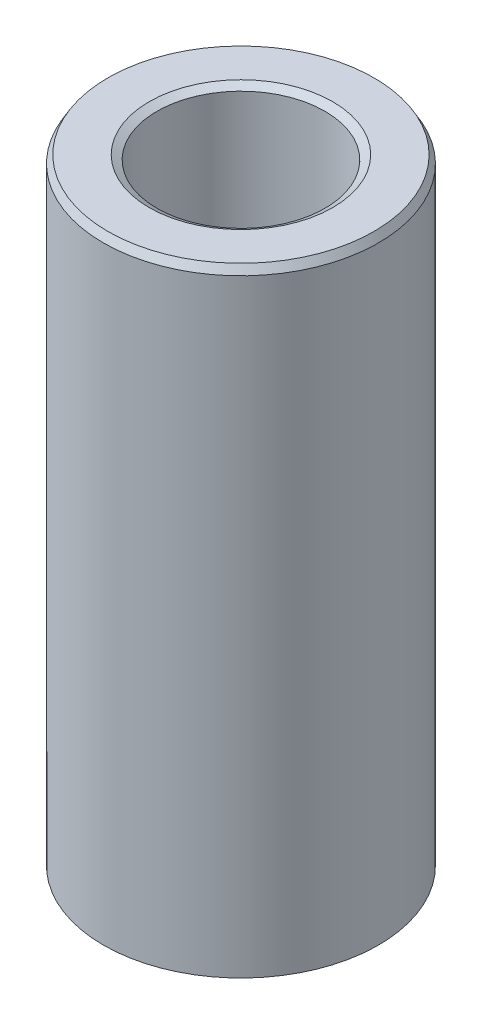
ISO-10303-21;
HEADER;
FILE_DESCRIPTION(('STEP AP214'),'2;1');
FILE_NAME('part.step','',(''),(''),'','','');
FILE_SCHEMA(('AUTOMOTIVE_DESIGN { 1 0 10303 214 1 1 1 1 }'));
ENDSEC;
DATA;
#1=APPLICATION_CONTEXT('core data for automotive mechanical design processes');
#2=APPLICATION_PROTOCOL_DEFINITION('international standard','automotive_design',2000,#1);
#3=PRODUCT_CONTEXT('',#1,'mechanical');
#4=PRODUCT('Part','Part','',(#3));
#5=PRODUCT_RELATED_PRODUCT_CATEGORY('part','',(#4));
#6=PRODUCT_DEFINITION_FORMATION('','',#4);
#7=PRODUCT_DEFINITION_CONTEXT('part definition',#1,'design');
#8=PRODUCT_DEFINITION('design','',#6,#7);
#9=PRODUCT_DEFINITION_SHAPE('','',#8);
#10=(LENGTH_UNIT() NAMED_UNIT(*) SI_UNIT(.MILLI.,.METRE.));
#11=(NAMED_UNIT(*) PLANE_ANGLE_UNIT() SI_UNIT($,.RADIAN.));
#12=(NAMED_UNIT(*) SI_UNIT($,.STERADIAN.) SOLID_ANGLE_UNIT());
#13=UNCERTAINTY_MEASURE_WITH_UNIT(LENGTH_MEASURE(1.E-05),#10,'distance_accuracy_value','');
#14=(GEOMETRIC_REPRESENTATION_CONTEXT(3) GLOBAL_UNCERTAINTY_ASSIGNED_CONTEXT((#13)) GLOBAL_UNIT_ASSIGNED_CONTEXT((#10,
#11,#12)) REPRESENTATION_CONTEXT('',''));
#15=CARTESIAN_POINT('',(0.,0.,0.));
#16=DIRECTION('',(0.,0.,1.));
#17=DIRECTION('',(1.,0.,0.));
#18=AXIS2_PLACEMENT_3D('',#15,#16,#17);
#19=CARTESIAN_POINT('',(0.,56.3848817626225,0.));
#20=DIRECTION('',(0.,-1.,0.));
#21=DIRECTION('',(0.,0.,-1.));
#22=AXIS2_PLACEMENT_3D('',#19,#20,#21);
#23=CYLINDRICAL_SURFACE('',#22,12.5);
#24=CARTESIAN_POINT('',(0.,0.404570411743452,0.));
#25=DIRECTION('',(0.,1.,0.));
#26=DIRECTION('',(0.,0.,1.));
#27=AXIS2_PLACEMENT_3D('',#24,#25,#26);
#28=CIRCLE('',#27,12.5);
#29=CARTESIAN_POINT('',(0.,0.404570411743452,12.5));
#30=VERTEX_POINT('',#29);
#31=EDGE_CURVE('E10',#30,#30,#28,.T.);
#32=ORIENTED_EDGE('',*,*,#31,.T.);
#33=EDGE_LOOP('',(#32));
#34=FACE_BOUND('',#33,.T.);
#35=CARTESIAN_POINT('',(0.,55.6841452542438,0.));
#36=DIRECTION('',(0.,1.,0.));
#37=DIRECTION('',(0.,0.,1.));
#38=AXIS2_PLACEMENT_3D('',#35,#36,#37);
#39=CIRCLE('',#38,12.5);
#40=CARTESIAN_POINT('',(0.,55.6841452542438,12.5));
#41=VERTEX_POINT('',#40);
#42=EDGE_CURVE('E50',#41,#41,#39,.F.);
#43=ORIENTED_EDGE('',*,*,#42,.T.);
#44=EDGE_LOOP('',(#43));
#45=FACE_BOUND('',#44,.T.);
#46=ADVANCED_FACE('F39',(#34,#45),#23,.T.);
#47=CARTESIAN_POINT('',(0.,56.3848817626225,0.));
#48=DIRECTION('',(0.,1.,0.));
#49=DIRECTION('',(0.,0.,1.));
#50=AXIS2_PLACEMENT_3D('',#47,#48,#49);
#51=PLANE('',#50);
#52=CARTESIAN_POINT('',(0.,56.3848817626225,0.));
#53=DIRECTION('',(0.,1.,0.));
#54=DIRECTION('',(0.,0.,1.));
#55=AXIS2_PLACEMENT_3D('',#52,#53,#54);
#56=CIRCLE('',#55,8.34144304614783);
#57=CARTESIAN_POINT('',(0.,56.3848817626225,8.34144304614783));
#58=VERTEX_POINT('',#57);
#59=EDGE_CURVE('E58',#58,#58,#56,.F.);
#60=ORIENTED_EDGE('',*,*,#59,.T.);
#61=EDGE_LOOP('',(#60));
#62=FACE_BOUND('',#61,.T.);
#63=CARTESIAN_POINT('',(0.,56.3848817626225,0.));
#64=DIRECTION('',(0.,1.,0.));
#65=DIRECTION('',(0.,0.,1.));
#66=AXIS2_PLACEMENT_3D('',#63,#64,#65);
#67=CIRCLE('',#66,12.0954295882565);
#68=CARTESIAN_POINT('',(0.,56.3848817626225,12.0954295882565));
#69=VERTEX_POINT('',#68);
#70=EDGE_CURVE('E61',#69,#69,#67,.T.);
#71=ORIENTED_EDGE('',*,*,#70,.T.);
#72=EDGE_LOOP('',(#71));
#73=FACE_BOUND('',#72,.T.);
#74=ADVANCED_FACE('F88',(#62,#73),#51,.T.);
#75=CARTESIAN_POINT('',(0.,0.,0.));
#76=DIRECTION('',(0.,1.,0.));
#77=DIRECTION('',(0.,0.,1.));
#78=AXIS2_PLACEMENT_3D('',#75,#76,#77);
#79=PLANE('',#78);
#80=CARTESIAN_POINT('',(0.,0.,0.));
#81=DIRECTION('',(0.,1.,0.));
#82=DIRECTION('',(0.,0.,1.));
#83=AXIS2_PLACEMENT_3D('',#80,#81,#82);
#84=CIRCLE('',#83,8.04527694951255);
#85=CARTESIAN_POINT('',(0.,0.,8.04527694951255));
#86=VERTEX_POINT('',#85);
#87=EDGE_CURVE('E51',#86,#86,#84,.T.);
#88=ORIENTED_EDGE('',*,*,#87,.T.);
#89=EDGE_LOOP('',(#88));
#90=FACE_BOUND('',#89,.T.);
#91=CARTESIAN_POINT('',(0.,0.,0.));
#92=DIRECTION('',(0.,1.,0.));
#93=DIRECTION('',(0.,0.,1.));
#94=AXIS2_PLACEMENT_3D('',#91,#92,#93);
#95=CIRCLE('',#94,11.7992634916213);
#96=CARTESIAN_POINT('',(0.,0.,11.7992634916213));
#97=VERTEX_POINT('',#96);
#98=EDGE_CURVE('E54',#97,#97,#95,.F.);
#99=ORIENTED_EDGE('',*,*,#98,.T.);
#100=EDGE_LOOP('',(#99));
#101=FACE_BOUND('',#100,.T.);
#102=ADVANCED_FACE('F83',(#90,#101),#79,.F.);
#103=CARTESIAN_POINT('',(0.,56.3848817626225,0.));
#104=DIRECTION('',(0.,-1.,0.));
#105=DIRECTION('',(0.,0.,-1.));
#106=AXIS2_PLACEMENT_3D('',#103,#104,#105);
#107=CYLINDRICAL_SURFACE('',#106,7.64070653776909);
#108=CARTESIAN_POINT('',(0.,55.980311350879,0.));
#109=DIRECTION('',(0.,1.,0.));
#110=DIRECTION('',(0.,0.,1.));
#111=AXIS2_PLACEMENT_3D('',#108,#109,#110);
#112=CIRCLE('',#111,7.64070653776909);
#113=CARTESIAN_POINT('',(0.,55.980311350879,7.64070653776909));
#114=VERTEX_POINT('',#113);
#115=EDGE_CURVE('E67',#114,#114,#112,.T.);
#116=ORIENTED_EDGE('',*,*,#115,.T.);
#117=EDGE_LOOP('',(#116));
#118=FACE_BOUND('',#117,.T.);
#119=CARTESIAN_POINT('',(0.,0.700736508378749,0.));
#120=DIRECTION('',(0.,1.,0.));
#121=DIRECTION('',(0.,0.,1.));
#122=AXIS2_PLACEMENT_3D('',#119,#120,#121);
#123=CIRCLE('',#122,7.64070653776909);
#124=CARTESIAN_POINT('',(0.,0.700736508378749,7.64070653776909));
#125=VERTEX_POINT('',#124);
#126=EDGE_CURVE('E69',#125,#125,#123,.F.);
#127=ORIENTED_EDGE('',*,*,#126,.T.);
#128=EDGE_LOOP('',(#127));
#129=FACE_BOUND('',#128,.T.);
#130=ADVANCED_FACE('F71',(#118,#129),#107,.F.);
#131=CARTESIAN_POINT('',(0.,55.980311350879,0.));
#132=DIRECTION('',(0.,1.,0.));
#133=DIRECTION('',(0.,0.,1.));
#134=AXIS2_PLACEMENT_3D('',#131,#132,#133);
#135=CONICAL_SURFACE('',#134,7.64070653776909,1.0471975511966);
#136=ORIENTED_EDGE('',*,*,#59,.F.);
#137=EDGE_LOOP('',(#136));
#138=FACE_BOUND('',#137,.T.);
#139=ORIENTED_EDGE('',*,*,#115,.F.);
#140=EDGE_LOOP('',(#139));
#141=FACE_BOUND('',#140,.T.);
#142=ADVANCED_FACE('F77',(#138,#141),#135,.F.);
#143=CARTESIAN_POINT('',(0.,0.,0.));
#144=DIRECTION('',(0.,-1.,0.));
#145=DIRECTION('',(0.,0.,-1.));
#146=AXIS2_PLACEMENT_3D('',#143,#144,#145);
#147=CONICAL_SURFACE('',#146,8.04527694951255,0.523598775598288);
#148=ORIENTED_EDGE('',*,*,#126,.F.);
#149=EDGE_LOOP('',(#148));
#150=FACE_BOUND('',#149,.T.);
#151=ORIENTED_EDGE('',*,*,#87,.F.);
#152=EDGE_LOOP('',(#151));
#153=FACE_BOUND('',#152,.T.);
#154=ADVANCED_FACE('F73',(#150,#153),#147,.F.);
#155=CARTESIAN_POINT('',(0.,0.404570411743452,0.));
#156=DIRECTION('',(0.,1.,0.));
#157=DIRECTION('',(0.,0.,1.));
#158=AXIS2_PLACEMENT_3D('',#155,#156,#157);
#159=CONICAL_SURFACE('',#158,12.5,1.04719755119661);
#160=ORIENTED_EDGE('',*,*,#98,.F.);
#161=EDGE_LOOP('',(#160));
#162=FACE_BOUND('',#161,.T.);
#163=ORIENTED_EDGE('',*,*,#31,.F.);
#164=EDGE_LOOP('',(#163));
#165=FACE_BOUND('',#164,.T.);
#166=ADVANCED_FACE('F76',(#162,#165),#159,.T.);
#167=CARTESIAN_POINT('',(0.,56.3848817626225,0.));
#168=DIRECTION('',(0.,-1.,0.));
#169=DIRECTION('',(0.,0.,-1.));
#170=AXIS2_PLACEMENT_3D('',#167,#168,#169);
#171=CONICAL_SURFACE('',#170,12.0954295882565,0.523598775598279);
#172=ORIENTED_EDGE('',*,*,#42,.F.);
#173=EDGE_LOOP('',(#172));
#174=FACE_BOUND('',#173,.T.);
#175=ORIENTED_EDGE('',*,*,#70,.F.);
#176=EDGE_LOOP('',(#175));
#177=FACE_BOUND('',#176,.T.);
#178=ADVANCED_FACE('F45',(#174,#177),#171,.T.);
#179=CLOSED_SHELL('',(#46,#74,#102,#130,#142,#154,#166,#178));
#180=MANIFOLD_SOLID_BREP('B2',#179);
#181=ADVANCED_BREP_SHAPE_REPRESENTATION('',(#18,#180),#14);
#182=SHAPE_DEFINITION_REPRESENTATION(#9,#181);
ENDSEC;
END-ISO-10303-21;
